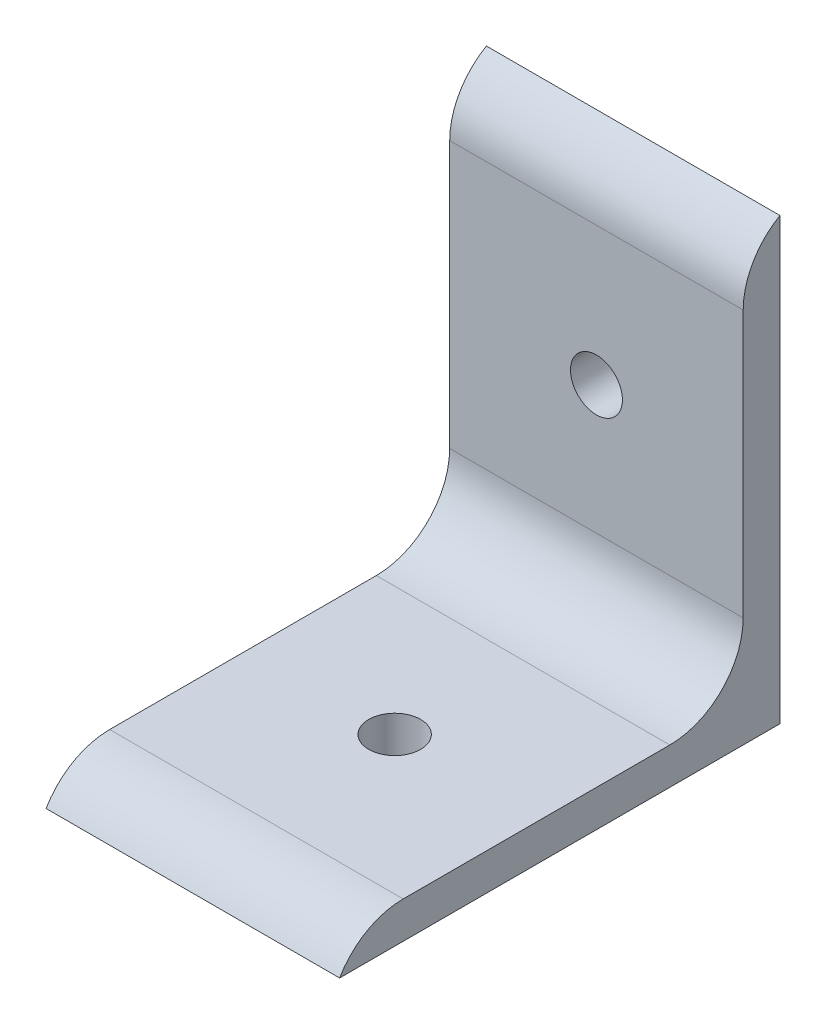
ISO-10303-21;
HEADER;
FILE_DESCRIPTION(('STEP AP214'),'2;1');
FILE_NAME('part.step','',(''),(''),'','','');
FILE_SCHEMA(('AUTOMOTIVE_DESIGN { 1 0 10303 214 1 1 1 1 }'));
ENDSEC;
DATA;
#1=APPLICATION_CONTEXT('core data for automotive mechanical design processes');
#2=APPLICATION_PROTOCOL_DEFINITION('international standard','automotive_design',2000,#1);
#3=PRODUCT_CONTEXT('',#1,'mechanical');
#4=PRODUCT('Part','Part','',(#3));
#5=PRODUCT_RELATED_PRODUCT_CATEGORY('part','',(#4));
#6=PRODUCT_DEFINITION_FORMATION('','',#4);
#7=PRODUCT_DEFINITION_CONTEXT('part definition',#1,'design');
#8=PRODUCT_DEFINITION('design','',#6,#7);
#9=PRODUCT_DEFINITION_SHAPE('','',#8);
#10=(LENGTH_UNIT() NAMED_UNIT(*) SI_UNIT(.MILLI.,.METRE.));
#11=(NAMED_UNIT(*) PLANE_ANGLE_UNIT() SI_UNIT($,.RADIAN.));
#12=(NAMED_UNIT(*) SI_UNIT($,.STERADIAN.) SOLID_ANGLE_UNIT());
#13=UNCERTAINTY_MEASURE_WITH_UNIT(LENGTH_MEASURE(1.E-05),#10,'distance_accuracy_value','');
#14=(GEOMETRIC_REPRESENTATION_CONTEXT(3) GLOBAL_UNCERTAINTY_ASSIGNED_CONTEXT((#13)) GLOBAL_UNIT_ASSIGNED_CONTEXT((#10,
#11,#12)) REPRESENTATION_CONTEXT('',''));
#15=CARTESIAN_POINT('',(0.,0.,0.));
#16=DIRECTION('',(0.,0.,1.));
#17=DIRECTION('',(1.,0.,0.));
#18=AXIS2_PLACEMENT_3D('',#15,#16,#17);
#19=CARTESIAN_POINT('',(25.4,0.,38.1));
#20=DIRECTION('',(0.,1.,0.));
#21=DIRECTION('',(0.,0.,1.));
#22=AXIS2_PLACEMENT_3D('',#19,#20,#21);
#23=PLANE('',#22);
#24=CARTESIAN_POINT('',(12.7,0.,20.6375));
#25=DIRECTION('',(0.,1.,0.));
#26=DIRECTION('',(0.,0.,1.));
#27=AXIS2_PLACEMENT_3D('',#24,#25,#26);
#28=CIRCLE('',#27,2.2479);
#29=CARTESIAN_POINT('',(12.7,0.,22.8854));
#30=VERTEX_POINT('',#29);
#31=EDGE_CURVE('E204',#30,#30,#28,.T.);
#32=ORIENTED_EDGE('',*,*,#31,.T.);
#33=EDGE_LOOP('',(#32));
#34=FACE_BOUND('',#33,.T.);
#35=DIRECTION('',(0.,0.,-1.));
#36=VECTOR('',#35,1.);
#37=CARTESIAN_POINT('',(0.,0.,38.1));
#38=LINE('',#37,#36);
#39=CARTESIAN_POINT('',(0.,0.,38.1));
#40=VERTEX_POINT('',#39);
#41=CARTESIAN_POINT('',(0.,0.,0.));
#42=VERTEX_POINT('',#41);
#43=EDGE_CURVE('E120',#40,#42,#38,.T.);
#44=ORIENTED_EDGE('',*,*,#43,.T.);
#45=DIRECTION('',(-1.,0.,0.));
#46=VECTOR('',#45,1.);
#47=CARTESIAN_POINT('',(25.4,0.,0.));
#48=LINE('',#47,#46);
#49=CARTESIAN_POINT('',(25.4,0.,0.));
#50=VERTEX_POINT('',#49);
#51=EDGE_CURVE('E102',#50,#42,#48,.T.);
#52=ORIENTED_EDGE('',*,*,#51,.F.);
#53=DIRECTION('',(0.,0.,-1.));
#54=VECTOR('',#53,1.);
#55=CARTESIAN_POINT('',(25.4,0.,38.1));
#56=LINE('',#55,#54);
#57=CARTESIAN_POINT('',(25.4,0.,38.1));
#58=VERTEX_POINT('',#57);
#59=EDGE_CURVE('E108',#58,#50,#56,.T.);
#60=ORIENTED_EDGE('',*,*,#59,.F.);
#61=DIRECTION('',(-1.,0.,0.));
#62=VECTOR('',#61,1.);
#63=CARTESIAN_POINT('',(25.4,0.,38.1));
#64=LINE('',#63,#62);
#65=EDGE_CURVE('E125',#58,#40,#64,.T.);
#66=ORIENTED_EDGE('',*,*,#65,.T.);
#67=EDGE_LOOP('',(#44,#52,#60,#66));
#68=FACE_BOUND('',#67,.T.);
#69=ADVANCED_FACE('F38',(#34,#68),#23,.F.);
#70=CARTESIAN_POINT('',(25.4,0.,0.));
#71=DIRECTION('',(0.,0.,1.));
#72=DIRECTION('',(1.,0.,0.));
#73=AXIS2_PLACEMENT_3D('',#70,#71,#72);
#74=PLANE('',#73);
#75=CARTESIAN_POINT('',(12.7,20.6375,0.));
#76=DIRECTION('',(0.,0.,1.));
#77=DIRECTION('',(1.,0.,0.));
#78=AXIS2_PLACEMENT_3D('',#75,#76,#77);
#79=CIRCLE('',#78,2.2479);
#80=CARTESIAN_POINT('',(14.9479,20.6375,0.));
#81=VERTEX_POINT('',#80);
#82=EDGE_CURVE('E162',#81,#81,#79,.T.);
#83=ORIENTED_EDGE('',*,*,#82,.T.);
#84=EDGE_LOOP('',(#83));
#85=FACE_BOUND('',#84,.T.);
#86=DIRECTION('',(0.,1.,0.));
#87=VECTOR('',#86,1.);
#88=CARTESIAN_POINT('',(0.,0.,0.));
#89=LINE('',#88,#87);
#90=CARTESIAN_POINT('',(0.,38.1,0.));
#91=VERTEX_POINT('',#90);
#92=EDGE_CURVE('E154',#42,#91,#89,.T.);
#93=ORIENTED_EDGE('',*,*,#92,.T.);
#94=DIRECTION('',(-1.,0.,0.));
#95=VECTOR('',#94,1.);
#96=CARTESIAN_POINT('',(25.4,38.1,0.));
#97=LINE('',#96,#95);
#98=CARTESIAN_POINT('',(25.4,38.1,0.));
#99=VERTEX_POINT('',#98);
#100=EDGE_CURVE('E105',#99,#91,#97,.T.);
#101=ORIENTED_EDGE('',*,*,#100,.F.);
#102=DIRECTION('',(0.,1.,0.));
#103=VECTOR('',#102,1.);
#104=CARTESIAN_POINT('',(25.4,0.,0.));
#105=LINE('',#104,#103);
#106=EDGE_CURVE('E97',#50,#99,#105,.T.);
#107=ORIENTED_EDGE('',*,*,#106,.F.);
#108=ORIENTED_EDGE('',*,*,#51,.T.);
#109=EDGE_LOOP('',(#93,#101,#107,#108));
#110=FACE_BOUND('',#109,.T.);
#111=ADVANCED_FACE('F100',(#85,#110),#74,.F.);
#112=CARTESIAN_POINT('',(25.4,38.1,3.175));
#113=DIRECTION('',(0.,0.,-1.));
#114=DIRECTION('',(0.,1.,0.));
#115=AXIS2_PLACEMENT_3D('',#112,#113,#114);
#116=PLANE('',#115);
#117=CARTESIAN_POINT('',(12.7,20.6375,3.17499999999999));
#118=DIRECTION('',(0.,0.,1.));
#119=DIRECTION('',(1.,0.,0.));
#120=AXIS2_PLACEMENT_3D('',#117,#118,#119);
#121=CIRCLE('',#120,2.2479);
#122=CARTESIAN_POINT('',(14.9479,20.6375,3.17499999999999));
#123=VERTEX_POINT('',#122);
#124=EDGE_CURVE('E209',#123,#123,#121,.T.);
#125=ORIENTED_EDGE('',*,*,#124,.F.);
#126=EDGE_LOOP('',(#125));
#127=FACE_BOUND('',#126,.T.);
#128=DIRECTION('',(0.,-1.,0.));
#129=VECTOR('',#128,1.);
#130=CARTESIAN_POINT('',(25.4,38.1,3.175));
#131=LINE('',#130,#129);
#132=CARTESIAN_POINT('',(25.4,32.6007386859688,3.175));
#133=VERTEX_POINT('',#132);
#134=CARTESIAN_POINT('',(25.4,9.525,3.17499999999999));
#135=VERTEX_POINT('',#134);
#136=EDGE_CURVE('E107',#133,#135,#131,.T.);
#137=ORIENTED_EDGE('',*,*,#136,.F.);
#138=DIRECTION('',(-1.,0.,0.));
#139=VECTOR('',#138,1.);
#140=CARTESIAN_POINT('',(25.4,32.6007386859688,3.175));
#141=LINE('',#140,#139);
#142=CARTESIAN_POINT('',(0.,32.6007386859688,3.175));
#143=VERTEX_POINT('',#142);
#144=EDGE_CURVE('E123',#133,#143,#141,.T.);
#145=ORIENTED_EDGE('',*,*,#144,.T.);
#146=DIRECTION('',(0.,-1.,0.));
#147=VECTOR('',#146,1.);
#148=CARTESIAN_POINT('',(0.,38.1,3.175));
#149=LINE('',#148,#147);
#150=CARTESIAN_POINT('',(0.,9.525,3.17499999999999));
#151=VERTEX_POINT('',#150);
#152=EDGE_CURVE('E146',#143,#151,#149,.T.);
#153=ORIENTED_EDGE('',*,*,#152,.T.);
#154=DIRECTION('',(-1.,0.,0.));
#155=VECTOR('',#154,1.);
#156=CARTESIAN_POINT('',(25.4,9.525,3.17499999999999));
#157=LINE('',#156,#155);
#158=EDGE_CURVE('E121',#151,#135,#157,.F.);
#159=ORIENTED_EDGE('',*,*,#158,.T.);
#160=EDGE_LOOP('',(#137,#145,#153,#159));
#161=FACE_BOUND('',#160,.T.);
#162=ADVANCED_FACE('F152',(#127,#161),#116,.F.);
#163=CARTESIAN_POINT('',(25.4,3.175,3.17499999999999));
#164=DIRECTION('',(0.,-1.,0.));
#165=DIRECTION('',(0.,0.,-1.));
#166=AXIS2_PLACEMENT_3D('',#163,#164,#165);
#167=PLANE('',#166);
#168=CARTESIAN_POINT('',(12.7,3.175,20.6375));
#169=DIRECTION('',(0.,1.,0.));
#170=DIRECTION('',(0.,0.,1.));
#171=AXIS2_PLACEMENT_3D('',#168,#169,#170);
#172=CIRCLE('',#171,2.2479);
#173=CARTESIAN_POINT('',(12.7,3.175,22.8854));
#174=VERTEX_POINT('',#173);
#175=EDGE_CURVE('E207',#174,#174,#172,.T.);
#176=ORIENTED_EDGE('',*,*,#175,.F.);
#177=EDGE_LOOP('',(#176));
#178=FACE_BOUND('',#177,.T.);
#179=DIRECTION('',(0.,0.,1.));
#180=VECTOR('',#179,1.);
#181=CARTESIAN_POINT('',(0.,3.175,3.17499999999999));
#182=LINE('',#181,#180);
#183=CARTESIAN_POINT('',(0.,3.175,9.525));
#184=VERTEX_POINT('',#183);
#185=CARTESIAN_POINT('',(0.,3.175,32.6007386859688));
#186=VERTEX_POINT('',#185);
#187=EDGE_CURVE('E117',#184,#186,#182,.T.);
#188=ORIENTED_EDGE('',*,*,#187,.T.);
#189=DIRECTION('',(1.,0.,0.));
#190=VECTOR('',#189,1.);
#191=CARTESIAN_POINT('',(25.4,3.175,32.6007386859688));
#192=LINE('',#191,#190);
#193=CARTESIAN_POINT('',(25.4,3.175,32.6007386859688));
#194=VERTEX_POINT('',#193);
#195=EDGE_CURVE('E53',#186,#194,#192,.T.);
#196=ORIENTED_EDGE('',*,*,#195,.T.);
#197=DIRECTION('',(0.,0.,1.));
#198=VECTOR('',#197,1.);
#199=CARTESIAN_POINT('',(25.4,3.175,3.17499999999999));
#200=LINE('',#199,#198);
#201=CARTESIAN_POINT('',(25.4,3.175,9.525));
#202=VERTEX_POINT('',#201);
#203=EDGE_CURVE('E157',#202,#194,#200,.T.);
#204=ORIENTED_EDGE('',*,*,#203,.F.);
#205=DIRECTION('',(-1.,0.,0.));
#206=VECTOR('',#205,1.);
#207=CARTESIAN_POINT('',(0.,3.175,9.525));
#208=LINE('',#207,#206);
#209=EDGE_CURVE('E138',#202,#184,#208,.T.);
#210=ORIENTED_EDGE('',*,*,#209,.T.);
#211=EDGE_LOOP('',(#188,#196,#204,#210));
#212=FACE_BOUND('',#211,.T.);
#213=ADVANCED_FACE('F156',(#178,#212),#167,.F.);
#214=CARTESIAN_POINT('',(25.4,0.,0.));
#215=DIRECTION('',(1.,0.,0.));
#216=DIRECTION('',(0.,0.,-1.));
#217=AXIS2_PLACEMENT_3D('',#214,#215,#216);
#218=PLANE('',#217);
#219=ORIENTED_EDGE('',*,*,#106,.T.);
#220=CARTESIAN_POINT('',(25.4,32.6007386859688,-3.175));
#221=DIRECTION('',(1.,0.,0.));
#222=DIRECTION('',(0.,0.,-1.));
#223=AXIS2_PLACEMENT_3D('',#220,#221,#222);
#224=CIRCLE('',#223,6.35);
#225=EDGE_CURVE('E136',#99,#133,#224,.T.);
#226=ORIENTED_EDGE('',*,*,#225,.T.);
#227=ORIENTED_EDGE('',*,*,#136,.T.);
#228=CARTESIAN_POINT('',(25.4,9.525,9.525));
#229=DIRECTION('',(1.,0.,0.));
#230=DIRECTION('',(0.,0.,-1.));
#231=AXIS2_PLACEMENT_3D('',#228,#229,#230);
#232=CIRCLE('',#231,6.35);
#233=EDGE_CURVE('E11',#135,#202,#232,.F.);
#234=ORIENTED_EDGE('',*,*,#233,.T.);
#235=ORIENTED_EDGE('',*,*,#203,.T.);
#236=CARTESIAN_POINT('',(25.4,-3.175,32.6007386859688));
#237=DIRECTION('',(1.,0.,0.));
#238=DIRECTION('',(0.,0.,-1.));
#239=AXIS2_PLACEMENT_3D('',#236,#237,#238);
#240=CIRCLE('',#239,6.35);
#241=EDGE_CURVE('E113',#194,#58,#240,.T.);
#242=ORIENTED_EDGE('',*,*,#241,.T.);
#243=ORIENTED_EDGE('',*,*,#59,.T.);
#244=EDGE_LOOP('',(#219,#226,#227,#234,#235,#242,#243));
#245=FACE_BOUND('',#244,.T.);
#246=ADVANCED_FACE('F111',(#245),#218,.T.);
#247=CARTESIAN_POINT('',(0.,0.,0.));
#248=DIRECTION('',(1.,0.,0.));
#249=DIRECTION('',(0.,0.,-1.));
#250=AXIS2_PLACEMENT_3D('',#247,#248,#249);
#251=PLANE('',#250);
#252=ORIENTED_EDGE('',*,*,#152,.F.);
#253=CARTESIAN_POINT('',(0.,32.6007386859688,-3.175));
#254=DIRECTION('',(1.,0.,0.));
#255=DIRECTION('',(0.,0.,-1.));
#256=AXIS2_PLACEMENT_3D('',#253,#254,#255);
#257=CIRCLE('',#256,6.35);
#258=EDGE_CURVE('E133',#143,#91,#257,.F.);
#259=ORIENTED_EDGE('',*,*,#258,.T.);
#260=ORIENTED_EDGE('',*,*,#92,.F.);
#261=ORIENTED_EDGE('',*,*,#43,.F.);
#262=CARTESIAN_POINT('',(0.,-3.175,32.6007386859688));
#263=DIRECTION('',(1.,0.,0.));
#264=DIRECTION('',(0.,0.,-1.));
#265=AXIS2_PLACEMENT_3D('',#262,#263,#264);
#266=CIRCLE('',#265,6.35);
#267=EDGE_CURVE('E131',#40,#186,#266,.F.);
#268=ORIENTED_EDGE('',*,*,#267,.T.);
#269=ORIENTED_EDGE('',*,*,#187,.F.);
#270=CARTESIAN_POINT('',(0.,9.525,9.525));
#271=DIRECTION('',(1.,0.,0.));
#272=DIRECTION('',(0.,0.,-1.));
#273=AXIS2_PLACEMENT_3D('',#270,#271,#272);
#274=CIRCLE('',#273,6.35);
#275=EDGE_CURVE('E46',#184,#151,#274,.T.);
#276=ORIENTED_EDGE('',*,*,#275,.T.);
#277=EDGE_LOOP('',(#252,#259,#260,#261,#268,#269,#276));
#278=FACE_BOUND('',#277,.T.);
#279=ADVANCED_FACE('F145',(#278),#251,.F.);
#280=CARTESIAN_POINT('',(25.4,32.6007386859688,-3.175));
#281=DIRECTION('',(-1.,0.,0.));
#282=DIRECTION('',(0.,0.,1.));
#283=AXIS2_PLACEMENT_3D('',#280,#281,#282);
#284=CYLINDRICAL_SURFACE('',#283,6.35);
#285=ORIENTED_EDGE('',*,*,#225,.F.);
#286=ORIENTED_EDGE('',*,*,#100,.T.);
#287=ORIENTED_EDGE('',*,*,#258,.F.);
#288=ORIENTED_EDGE('',*,*,#144,.F.);
#289=EDGE_LOOP('',(#285,#286,#287,#288));
#290=FACE_BOUND('',#289,.T.);
#291=ADVANCED_FACE('F165',(#290),#284,.T.);
#292=CARTESIAN_POINT('',(25.4,-3.175,32.6007386859688));
#293=DIRECTION('',(1.,0.,0.));
#294=DIRECTION('',(0.,0.,-1.));
#295=AXIS2_PLACEMENT_3D('',#292,#293,#294);
#296=CYLINDRICAL_SURFACE('',#295,6.35);
#297=ORIENTED_EDGE('',*,*,#241,.F.);
#298=ORIENTED_EDGE('',*,*,#195,.F.);
#299=ORIENTED_EDGE('',*,*,#267,.F.);
#300=ORIENTED_EDGE('',*,*,#65,.F.);
#301=EDGE_LOOP('',(#297,#298,#299,#300));
#302=FACE_BOUND('',#301,.T.);
#303=ADVANCED_FACE('F167',(#302),#296,.T.);
#304=CARTESIAN_POINT('',(25.4,9.525,9.525));
#305=DIRECTION('',(1.,0.,0.));
#306=DIRECTION('',(0.,0.,-1.));
#307=AXIS2_PLACEMENT_3D('',#304,#305,#306);
#308=CYLINDRICAL_SURFACE('',#307,6.35);
#309=ORIENTED_EDGE('',*,*,#233,.F.);
#310=ORIENTED_EDGE('',*,*,#158,.F.);
#311=ORIENTED_EDGE('',*,*,#275,.F.);
#312=ORIENTED_EDGE('',*,*,#209,.F.);
#313=EDGE_LOOP('',(#309,#310,#311,#312));
#314=FACE_BOUND('',#313,.T.);
#315=ADVANCED_FACE('F40',(#314),#308,.F.);
#316=CARTESIAN_POINT('',(12.7,20.6375,3.17499999999999));
#317=DIRECTION('',(0.,0.,1.));
#318=DIRECTION('',(1.,0.,0.));
#319=AXIS2_PLACEMENT_3D('',#316,#317,#318);
#320=CYLINDRICAL_SURFACE('',#319,2.2479);
#321=ORIENTED_EDGE('',*,*,#82,.F.);
#322=EDGE_LOOP('',(#321));
#323=FACE_BOUND('',#322,.T.);
#324=ORIENTED_EDGE('',*,*,#124,.T.);
#325=EDGE_LOOP('',(#324));
#326=FACE_BOUND('',#325,.T.);
#327=ADVANCED_FACE('F193',(#323,#326),#320,.F.);
#328=CARTESIAN_POINT('',(12.7,3.175,20.6375));
#329=DIRECTION('',(0.,1.,0.));
#330=DIRECTION('',(0.,0.,1.));
#331=AXIS2_PLACEMENT_3D('',#328,#329,#330);
#332=CYLINDRICAL_SURFACE('',#331,2.2479);
#333=ORIENTED_EDGE('',*,*,#31,.F.);
#334=EDGE_LOOP('',(#333));
#335=FACE_BOUND('',#334,.T.);
#336=ORIENTED_EDGE('',*,*,#175,.T.);
#337=EDGE_LOOP('',(#336));
#338=FACE_BOUND('',#337,.T.);
#339=ADVANCED_FACE('F196',(#335,#338),#332,.F.);
#340=CLOSED_SHELL('',(#69,#111,#162,#213,#246,#279,#291,#303,#315,#327,#339));
#341=MANIFOLD_SOLID_BREP('B2',#340);
#342=ADVANCED_BREP_SHAPE_REPRESENTATION('',(#18,#341),#14);
#343=SHAPE_DEFINITION_REPRESENTATION(#9,#342);
ENDSEC;
END-ISO-10303-21;
